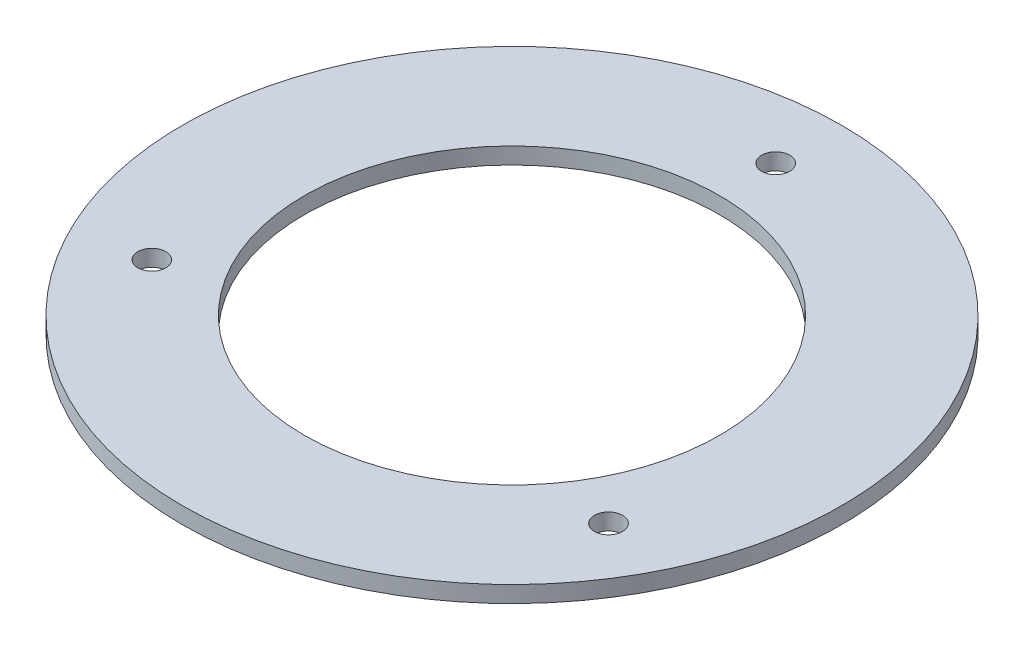
ISO-10303-21;
HEADER;
FILE_DESCRIPTION(('STEP AP214'),'2;1');
FILE_NAME('part.step','',(''),(''),'','','');
FILE_SCHEMA(('AUTOMOTIVE_DESIGN { 1 0 10303 214 1 1 1 1 }'));
ENDSEC;
DATA;
#1=APPLICATION_CONTEXT('core data for automotive mechanical design processes');
#2=APPLICATION_PROTOCOL_DEFINITION('international standard','automotive_design',2000,#1);
#3=PRODUCT_CONTEXT('',#1,'mechanical');
#4=PRODUCT('Part','Part','',(#3));
#5=PRODUCT_RELATED_PRODUCT_CATEGORY('part','',(#4));
#6=PRODUCT_DEFINITION_FORMATION('','',#4);
#7=PRODUCT_DEFINITION_CONTEXT('part definition',#1,'design');
#8=PRODUCT_DEFINITION('design','',#6,#7);
#9=PRODUCT_DEFINITION_SHAPE('','',#8);
#10=(LENGTH_UNIT() NAMED_UNIT(*) SI_UNIT(.MILLI.,.METRE.));
#11=(NAMED_UNIT(*) PLANE_ANGLE_UNIT() SI_UNIT($,.RADIAN.));
#12=(NAMED_UNIT(*) SI_UNIT($,.STERADIAN.) SOLID_ANGLE_UNIT());
#13=UNCERTAINTY_MEASURE_WITH_UNIT(LENGTH_MEASURE(1.E-05),#10,'distance_accuracy_value','');
#14=(GEOMETRIC_REPRESENTATION_CONTEXT(3) GLOBAL_UNCERTAINTY_ASSIGNED_CONTEXT((#13)) GLOBAL_UNIT_ASSIGNED_CONTEXT((#10,
#11,#12)) REPRESENTATION_CONTEXT('',''));
#15=CARTESIAN_POINT('',(0.,0.,0.));
#16=DIRECTION('',(0.,0.,1.));
#17=DIRECTION('',(1.,0.,0.));
#18=AXIS2_PLACEMENT_3D('',#15,#16,#17);
#19=CARTESIAN_POINT('',(0.,3.18,0.));
#20=DIRECTION('',(0.,-1.,0.));
#21=DIRECTION('',(0.,0.,-1.));
#22=AXIS2_PLACEMENT_3D('',#19,#20,#21);
#23=CYLINDRICAL_SURFACE('',#22,63.5);
#24=CARTESIAN_POINT('',(0.,3.18,0.));
#25=DIRECTION('',(0.,1.,0.));
#26=DIRECTION('',(0.,0.,1.));
#27=AXIS2_PLACEMENT_3D('',#24,#25,#26);
#28=CIRCLE('',#27,63.5);
#29=CARTESIAN_POINT('',(0.,3.18,63.5));
#30=VERTEX_POINT('',#29);
#31=EDGE_CURVE('E10',#30,#30,#28,.T.);
#32=ORIENTED_EDGE('',*,*,#31,.F.);
#33=EDGE_LOOP('',(#32));
#34=FACE_BOUND('',#33,.T.);
#35=CARTESIAN_POINT('',(0.,0.,0.));
#36=DIRECTION('',(0.,1.,0.));
#37=DIRECTION('',(0.,0.,1.));
#38=AXIS2_PLACEMENT_3D('',#35,#36,#37);
#39=CIRCLE('',#38,63.5);
#40=CARTESIAN_POINT('',(0.,0.,63.5));
#41=VERTEX_POINT('',#40);
#42=EDGE_CURVE('E48',#41,#41,#39,.T.);
#43=ORIENTED_EDGE('',*,*,#42,.T.);
#44=EDGE_LOOP('',(#43));
#45=FACE_BOUND('',#44,.T.);
#46=ADVANCED_FACE('F40',(#34,#45),#23,.T.);
#47=CARTESIAN_POINT('',(0.,3.18,0.));
#48=DIRECTION('',(0.,1.,0.));
#49=DIRECTION('',(0.,0.,1.));
#50=AXIS2_PLACEMENT_3D('',#47,#48,#49);
#51=PLANE('',#50);
#52=CARTESIAN_POINT('',(43.9940905122497,3.18,25.3999999999996));
#53=DIRECTION('',(0.,1.,0.));
#54=DIRECTION('',(0.,0.,1.));
#55=AXIS2_PLACEMENT_3D('',#52,#53,#54);
#56=CIRCLE('',#55,2.70509999999999);
#57=CARTESIAN_POINT('',(43.9940905122497,3.18,28.1050999999996));
#58=VERTEX_POINT('',#57);
#59=EDGE_CURVE('E77',#58,#58,#56,.T.);
#60=ORIENTED_EDGE('',*,*,#59,.F.);
#61=EDGE_LOOP('',(#60));
#62=FACE_BOUND('',#61,.T.);
#63=CARTESIAN_POINT('',(-43.9940905122494,3.18,25.4000000000002));
#64=DIRECTION('',(0.,1.,0.));
#65=DIRECTION('',(0.,0.,1.));
#66=AXIS2_PLACEMENT_3D('',#63,#64,#65);
#67=CIRCLE('',#66,2.70509999999999);
#68=CARTESIAN_POINT('',(-43.9940905122494,3.18,28.1051000000002));
#69=VERTEX_POINT('',#68);
#70=EDGE_CURVE('E63',#69,#69,#67,.T.);
#71=ORIENTED_EDGE('',*,*,#70,.F.);
#72=EDGE_LOOP('',(#71));
#73=FACE_BOUND('',#72,.T.);
#74=CARTESIAN_POINT('',(0.,3.18,-50.8));
#75=DIRECTION('',(0.,1.,0.));
#76=DIRECTION('',(0.,0.,1.));
#77=AXIS2_PLACEMENT_3D('',#74,#75,#76);
#78=CIRCLE('',#77,2.7051);
#79=CARTESIAN_POINT('',(0.,3.18,-48.0949));
#80=VERTEX_POINT('',#79);
#81=EDGE_CURVE('E62',#80,#80,#78,.T.);
#82=ORIENTED_EDGE('',*,*,#81,.F.);
#83=EDGE_LOOP('',(#82));
#84=FACE_BOUND('',#83,.T.);
#85=CARTESIAN_POINT('',(0.,3.18,0.));
#86=DIRECTION('',(0.,1.,0.));
#87=DIRECTION('',(0.,0.,1.));
#88=AXIS2_PLACEMENT_3D('',#85,#86,#87);
#89=CIRCLE('',#88,40.005);
#90=CARTESIAN_POINT('',(0.,3.18,40.005));
#91=VERTEX_POINT('',#90);
#92=EDGE_CURVE('E57',#91,#91,#89,.T.);
#93=ORIENTED_EDGE('',*,*,#92,.F.);
#94=EDGE_LOOP('',(#93));
#95=FACE_BOUND('',#94,.T.);
#96=ORIENTED_EDGE('',*,*,#31,.T.);
#97=EDGE_LOOP('',(#96));
#98=FACE_BOUND('',#97,.T.);
#99=ADVANCED_FACE('F92',(#62,#73,#84,#95,#98),#51,.T.);
#100=CARTESIAN_POINT('',(0.,0.,0.));
#101=DIRECTION('',(0.,1.,0.));
#102=DIRECTION('',(0.,0.,1.));
#103=AXIS2_PLACEMENT_3D('',#100,#101,#102);
#104=PLANE('',#103);
#105=CARTESIAN_POINT('',(43.9940905122497,0.,25.3999999999996));
#106=DIRECTION('',(0.,1.,0.));
#107=DIRECTION('',(0.,0.,1.));
#108=AXIS2_PLACEMENT_3D('',#105,#106,#107);
#109=CIRCLE('',#108,2.70509999999999);
#110=CARTESIAN_POINT('',(43.9940905122497,0.,28.1050999999996));
#111=VERTEX_POINT('',#110);
#112=EDGE_CURVE('E43',#111,#111,#109,.T.);
#113=ORIENTED_EDGE('',*,*,#112,.T.);
#114=EDGE_LOOP('',(#113));
#115=FACE_BOUND('',#114,.T.);
#116=CARTESIAN_POINT('',(-43.9940905122494,0.,25.4000000000002));
#117=DIRECTION('',(0.,1.,0.));
#118=DIRECTION('',(0.,0.,1.));
#119=AXIS2_PLACEMENT_3D('',#116,#117,#118);
#120=CIRCLE('',#119,2.70509999999999);
#121=CARTESIAN_POINT('',(-43.9940905122494,0.,28.1051000000002));
#122=VERTEX_POINT('',#121);
#123=EDGE_CURVE('E59',#122,#122,#120,.T.);
#124=ORIENTED_EDGE('',*,*,#123,.T.);
#125=EDGE_LOOP('',(#124));
#126=FACE_BOUND('',#125,.T.);
#127=CARTESIAN_POINT('',(0.,0.,-50.8));
#128=DIRECTION('',(0.,1.,0.));
#129=DIRECTION('',(0.,0.,1.));
#130=AXIS2_PLACEMENT_3D('',#127,#128,#129);
#131=CIRCLE('',#130,2.7051);
#132=CARTESIAN_POINT('',(0.,0.,-48.0949));
#133=VERTEX_POINT('',#132);
#134=EDGE_CURVE('E69',#133,#133,#131,.T.);
#135=ORIENTED_EDGE('',*,*,#134,.T.);
#136=EDGE_LOOP('',(#135));
#137=FACE_BOUND('',#136,.T.);
#138=CARTESIAN_POINT('',(0.,0.,0.));
#139=DIRECTION('',(0.,1.,0.));
#140=DIRECTION('',(0.,0.,1.));
#141=AXIS2_PLACEMENT_3D('',#138,#139,#140);
#142=CIRCLE('',#141,40.005);
#143=CARTESIAN_POINT('',(0.,0.,40.005));
#144=VERTEX_POINT('',#143);
#145=EDGE_CURVE('E54',#144,#144,#142,.T.);
#146=ORIENTED_EDGE('',*,*,#145,.T.);
#147=EDGE_LOOP('',(#146));
#148=FACE_BOUND('',#147,.T.);
#149=ORIENTED_EDGE('',*,*,#42,.F.);
#150=EDGE_LOOP('',(#149));
#151=FACE_BOUND('',#150,.T.);
#152=ADVANCED_FACE('F94',(#115,#126,#137,#148,#151),#104,.F.);
#153=CARTESIAN_POINT('',(0.,0.,0.));
#154=DIRECTION('',(0.,1.,0.));
#155=DIRECTION('',(0.,0.,1.));
#156=AXIS2_PLACEMENT_3D('',#153,#154,#155);
#157=CYLINDRICAL_SURFACE('',#156,40.005);
#158=ORIENTED_EDGE('',*,*,#145,.F.);
#159=EDGE_LOOP('',(#158));
#160=FACE_BOUND('',#159,.T.);
#161=ORIENTED_EDGE('',*,*,#92,.T.);
#162=EDGE_LOOP('',(#161));
#163=FACE_BOUND('',#162,.T.);
#164=ADVANCED_FACE('F90',(#160,#163),#157,.F.);
#165=CARTESIAN_POINT('',(0.,3.18,-50.8));
#166=DIRECTION('',(0.,1.,0.));
#167=DIRECTION('',(0.,0.,1.));
#168=AXIS2_PLACEMENT_3D('',#165,#166,#167);
#169=CYLINDRICAL_SURFACE('',#168,2.7051);
#170=ORIENTED_EDGE('',*,*,#81,.T.);
#171=EDGE_LOOP('',(#170));
#172=FACE_BOUND('',#171,.T.);
#173=ORIENTED_EDGE('',*,*,#134,.F.);
#174=EDGE_LOOP('',(#173));
#175=FACE_BOUND('',#174,.T.);
#176=ADVANCED_FACE('F108',(#172,#175),#169,.F.);
#177=CARTESIAN_POINT('',(-43.9940905122494,3.18,25.4000000000002));
#178=DIRECTION('',(0.,1.,0.));
#179=DIRECTION('',(0.,0.,1.));
#180=AXIS2_PLACEMENT_3D('',#177,#178,#179);
#181=CYLINDRICAL_SURFACE('',#180,2.70509999999999);
#182=ORIENTED_EDGE('',*,*,#70,.T.);
#183=EDGE_LOOP('',(#182));
#184=FACE_BOUND('',#183,.T.);
#185=ORIENTED_EDGE('',*,*,#123,.F.);
#186=EDGE_LOOP('',(#185));
#187=FACE_BOUND('',#186,.T.);
#188=ADVANCED_FACE('F112',(#184,#187),#181,.F.);
#189=CARTESIAN_POINT('',(43.9940905122497,3.18,25.3999999999996));
#190=DIRECTION('',(0.,1.,0.));
#191=DIRECTION('',(0.,0.,1.));
#192=AXIS2_PLACEMENT_3D('',#189,#190,#191);
#193=CYLINDRICAL_SURFACE('',#192,2.70509999999999);
#194=ORIENTED_EDGE('',*,*,#59,.T.);
#195=EDGE_LOOP('',(#194));
#196=FACE_BOUND('',#195,.T.);
#197=ORIENTED_EDGE('',*,*,#112,.F.);
#198=EDGE_LOOP('',(#197));
#199=FACE_BOUND('',#198,.T.);
#200=ADVANCED_FACE('F116',(#196,#199),#193,.F.);
#201=CLOSED_SHELL('',(#46,#99,#152,#164,#176,#188,#200));
#202=MANIFOLD_SOLID_BREP('B2',#201);
#203=ADVANCED_BREP_SHAPE_REPRESENTATION('',(#18,#202),#14);
#204=SHAPE_DEFINITION_REPRESENTATION(#9,#203);
ENDSEC;
END-ISO-10303-21;
